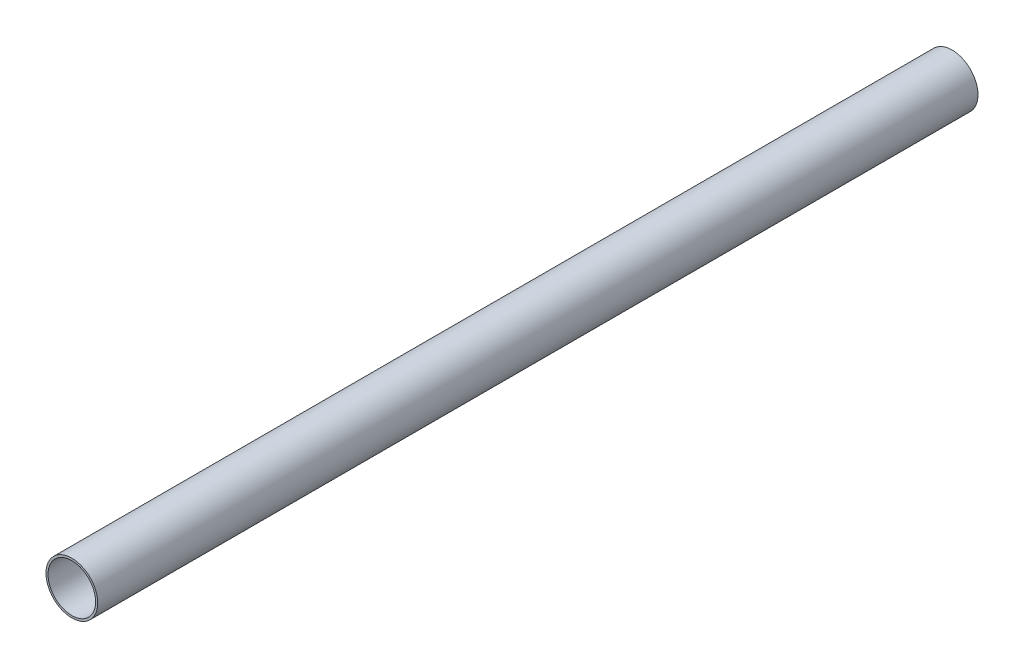
ISO-10303-21;
HEADER;
FILE_DESCRIPTION(('STEP AP214'),'2;1');
FILE_NAME('part.step','',(''),(''),'','','');
FILE_SCHEMA(('AUTOMOTIVE_DESIGN { 1 0 10303 214 1 1 1 1 }'));
ENDSEC;
DATA;
#1=APPLICATION_CONTEXT('core data for automotive mechanical design processes');
#2=APPLICATION_PROTOCOL_DEFINITION('international standard','automotive_design',2000,#1);
#3=PRODUCT_CONTEXT('',#1,'mechanical');
#4=PRODUCT('Part','Part','',(#3));
#5=PRODUCT_RELATED_PRODUCT_CATEGORY('part','',(#4));
#6=PRODUCT_DEFINITION_FORMATION('','',#4);
#7=PRODUCT_DEFINITION_CONTEXT('part definition',#1,'design');
#8=PRODUCT_DEFINITION('design','',#6,#7);
#9=PRODUCT_DEFINITION_SHAPE('','',#8);
#10=(LENGTH_UNIT() NAMED_UNIT(*) SI_UNIT(.MILLI.,.METRE.));
#11=(NAMED_UNIT(*) PLANE_ANGLE_UNIT() SI_UNIT($,.RADIAN.));
#12=(NAMED_UNIT(*) SI_UNIT($,.STERADIAN.) SOLID_ANGLE_UNIT());
#13=UNCERTAINTY_MEASURE_WITH_UNIT(LENGTH_MEASURE(1.E-05),#10,'distance_accuracy_value','');
#14=(GEOMETRIC_REPRESENTATION_CONTEXT(3) GLOBAL_UNCERTAINTY_ASSIGNED_CONTEXT((#13)) GLOBAL_UNIT_ASSIGNED_CONTEXT((#10,
#11,#12)) REPRESENTATION_CONTEXT('',''));
#15=CARTESIAN_POINT('',(0.,0.,0.));
#16=DIRECTION('',(0.,0.,1.));
#17=DIRECTION('',(1.,0.,0.));
#18=AXIS2_PLACEMENT_3D('',#15,#16,#17);
#19=CARTESIAN_POINT('',(0.,0.,1700.));
#20=DIRECTION('',(0.,0.,1.));
#21=DIRECTION('',(1.,0.,0.));
#22=AXIS2_PLACEMENT_3D('',#19,#20,#21);
#23=PLANE('',#22);
#24=CARTESIAN_POINT('',(0.,0.,1700.));
#25=DIRECTION('',(0.,0.,1.));
#26=DIRECTION('',(1.,0.,0.));
#27=AXIS2_PLACEMENT_3D('',#24,#25,#26);
#28=CIRCLE('',#27,50.);
#29=CARTESIAN_POINT('',(50.,0.,1700.));
#30=VERTEX_POINT('',#29);
#31=EDGE_CURVE('E10',#30,#30,#28,.T.);
#32=ORIENTED_EDGE('',*,*,#31,.T.);
#33=EDGE_LOOP('',(#32));
#34=FACE_BOUND('',#33,.T.);
#35=CARTESIAN_POINT('',(0.,0.,1700.));
#36=DIRECTION('',(0.,0.,1.));
#37=DIRECTION('',(1.,0.,0.));
#38=AXIS2_PLACEMENT_3D('',#35,#36,#37);
#39=CIRCLE('',#38,46.);
#40=CARTESIAN_POINT('',(46.,0.,1700.));
#41=VERTEX_POINT('',#40);
#42=EDGE_CURVE('E50',#41,#41,#39,.T.);
#43=ORIENTED_EDGE('',*,*,#42,.F.);
#44=EDGE_LOOP('',(#43));
#45=FACE_BOUND('',#44,.T.);
#46=ADVANCED_FACE('F39',(#34,#45),#23,.T.);
#47=CARTESIAN_POINT('',(0.,0.,0.));
#48=DIRECTION('',(0.,0.,1.));
#49=DIRECTION('',(1.,0.,0.));
#50=AXIS2_PLACEMENT_3D('',#47,#48,#49);
#51=PLANE('',#50);
#52=CARTESIAN_POINT('',(0.,0.,0.));
#53=DIRECTION('',(0.,0.,1.));
#54=DIRECTION('',(1.,0.,0.));
#55=AXIS2_PLACEMENT_3D('',#52,#53,#54);
#56=CIRCLE('',#55,50.);
#57=CARTESIAN_POINT('',(50.,0.,0.));
#58=VERTEX_POINT('',#57);
#59=EDGE_CURVE('E43',#58,#58,#56,.T.);
#60=ORIENTED_EDGE('',*,*,#59,.F.);
#61=EDGE_LOOP('',(#60));
#62=FACE_BOUND('',#61,.T.);
#63=CARTESIAN_POINT('',(0.,0.,0.));
#64=DIRECTION('',(0.,0.,1.));
#65=DIRECTION('',(1.,0.,0.));
#66=AXIS2_PLACEMENT_3D('',#63,#64,#65);
#67=CIRCLE('',#66,46.);
#68=CARTESIAN_POINT('',(46.,0.,0.));
#69=VERTEX_POINT('',#68);
#70=EDGE_CURVE('E52',#69,#69,#67,.T.);
#71=ORIENTED_EDGE('',*,*,#70,.T.);
#72=EDGE_LOOP('',(#71));
#73=FACE_BOUND('',#72,.T.);
#74=ADVANCED_FACE('F62',(#62,#73),#51,.F.);
#75=CARTESIAN_POINT('',(0.,0.,1700.));
#76=DIRECTION('',(0.,0.,-1.));
#77=DIRECTION('',(-1.,0.,0.));
#78=AXIS2_PLACEMENT_3D('',#75,#76,#77);
#79=CYLINDRICAL_SURFACE('',#78,50.);
#80=ORIENTED_EDGE('',*,*,#31,.F.);
#81=EDGE_LOOP('',(#80));
#82=FACE_BOUND('',#81,.T.);
#83=ORIENTED_EDGE('',*,*,#59,.T.);
#84=EDGE_LOOP('',(#83));
#85=FACE_BOUND('',#84,.T.);
#86=ADVANCED_FACE('F41',(#82,#85),#79,.T.);
#87=CARTESIAN_POINT('',(0.,0.,1700.));
#88=DIRECTION('',(0.,0.,-1.));
#89=DIRECTION('',(-1.,0.,0.));
#90=AXIS2_PLACEMENT_3D('',#87,#88,#89);
#91=CYLINDRICAL_SURFACE('',#90,46.);
#92=ORIENTED_EDGE('',*,*,#42,.T.);
#93=EDGE_LOOP('',(#92));
#94=FACE_BOUND('',#93,.T.);
#95=ORIENTED_EDGE('',*,*,#70,.F.);
#96=EDGE_LOOP('',(#95));
#97=FACE_BOUND('',#96,.T.);
#98=ADVANCED_FACE('F58',(#94,#97),#91,.F.);
#99=CLOSED_SHELL('',(#46,#74,#86,#98));
#100=MANIFOLD_SOLID_BREP('B2',#99);
#101=ADVANCED_BREP_SHAPE_REPRESENTATION('',(#18,#100),#14);
#102=SHAPE_DEFINITION_REPRESENTATION(#9,#101);
ENDSEC;
END-ISO-10303-21;
